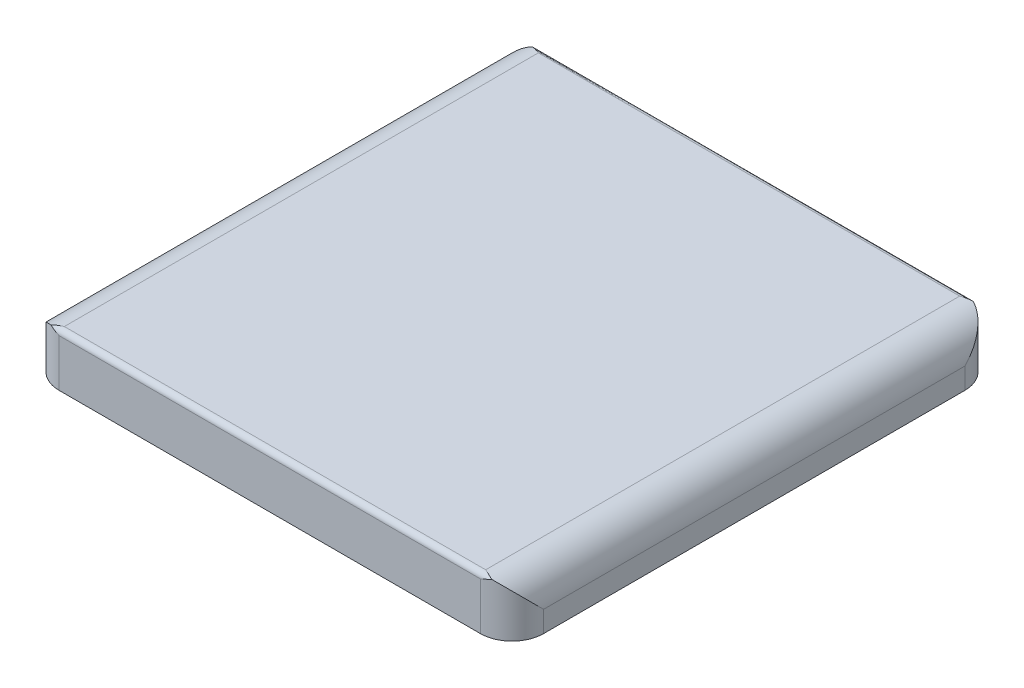
ISO-10303-21;
HEADER;
FILE_DESCRIPTION(('STEP AP214'),'2;1');
FILE_NAME('part.step','',(''),(''),'','','');
FILE_SCHEMA(('AUTOMOTIVE_DESIGN { 1 0 10303 214 1 1 1 1 }'));
ENDSEC;
DATA;
#1=APPLICATION_CONTEXT('core data for automotive mechanical design processes');
#2=APPLICATION_PROTOCOL_DEFINITION('international standard','automotive_design',2000,#1);
#3=PRODUCT_CONTEXT('',#1,'mechanical');
#4=PRODUCT('Part','Part','',(#3));
#5=PRODUCT_RELATED_PRODUCT_CATEGORY('part','',(#4));
#6=PRODUCT_DEFINITION_FORMATION('','',#4);
#7=PRODUCT_DEFINITION_CONTEXT('part definition',#1,'design');
#8=PRODUCT_DEFINITION('design','',#6,#7);
#9=PRODUCT_DEFINITION_SHAPE('','',#8);
#10=(LENGTH_UNIT() NAMED_UNIT(*) SI_UNIT(.MILLI.,.METRE.));
#11=(NAMED_UNIT(*) PLANE_ANGLE_UNIT() SI_UNIT($,.RADIAN.));
#12=(NAMED_UNIT(*) SI_UNIT($,.STERADIAN.) SOLID_ANGLE_UNIT());
#13=UNCERTAINTY_MEASURE_WITH_UNIT(LENGTH_MEASURE(1.E-05),#10,'distance_accuracy_value','');
#14=(GEOMETRIC_REPRESENTATION_CONTEXT(3) GLOBAL_UNCERTAINTY_ASSIGNED_CONTEXT((#13)) GLOBAL_UNIT_ASSIGNED_CONTEXT((#10,
#11,#12)) REPRESENTATION_CONTEXT('',''));
#15=CARTESIAN_POINT('',(0.,0.,0.));
#16=DIRECTION('',(0.,0.,1.));
#17=DIRECTION('',(1.,0.,0.));
#18=AXIS2_PLACEMENT_3D('',#15,#16,#17);
#19=CARTESIAN_POINT('',(50.8,12.7,50.8));
#20=DIRECTION('',(0.,-1.,0.));
#21=DIRECTION('',(0.,0.,-1.));
#22=AXIS2_PLACEMENT_3D('',#19,#20,#21);
#23=CYLINDRICAL_SURFACE('',#22,7.62);
#24=CARTESIAN_POINT('',(50.8,5.08,50.8));
#25=DIRECTION('',(0.,-0.707106781186547,0.707106781186547));
#26=DIRECTION('',(0.,0.707106781186547,0.707106781186547));
#27=AXIS2_PLACEMENT_3D('',#24,#25,#26);
#28=ELLIPSE('',#27,10.776307345283,7.62);
#29=CARTESIAN_POINT('',(58.42,5.08,50.7999999999999));
#30=VERTEX_POINT('',#29);
#31=CARTESIAN_POINT('',(53.1517067687622,12.3280256121069,58.0480256121069));
#32=VERTEX_POINT('',#31);
#33=EDGE_CURVE('E300',#30,#32,#28,.T.);
#34=ORIENTED_EDGE('',*,*,#33,.T.);
#35=CARTESIAN_POINT('',(53.1517067687622,12.3280256121069,58.0480256121069));
#36=CARTESIAN_POINT('',(53.0550511673587,12.2966572162024,58.0793845450704));
#37=CARTESIAN_POINT('',(52.9581477514544,12.264075271135,58.1086911967974));
#38=CARTESIAN_POINT('',(52.7639299968628,12.1968678296105,58.1632573798279));
#39=CARTESIAN_POINT('',(52.6666157346316,12.1622426990522,58.1885176327787));
#40=CARTESIAN_POINT('',(52.3741872794072,12.0558802809113,58.2583173565654));
#41=CARTESIAN_POINT('',(52.1785323287841,11.9816376831499,58.2968935685618));
#42=CARTESIAN_POINT('',(51.7885724327903,11.8298651623855,58.3581527388329));
#43=CARTESIAN_POINT('',(51.5942758205825,11.7523795583816,58.3810033255013));
#44=CARTESIAN_POINT('',(51.2053523408344,11.5954603856371,58.4117084896607));
#45=CARTESIAN_POINT('',(51.0107256756831,11.5160277662501,58.4195702338908));
#46=CARTESIAN_POINT('',(50.8107755866058,11.434399114484,58.4199942835861));
#47=CARTESIAN_POINT('',(50.8053877656628,11.4321995453163,58.4199999976133));
#48=CARTESIAN_POINT('',(50.8,11.43,58.42));
#49=B_SPLINE_CURVE_WITH_KNOTS('',3,(#35,#36,#37,#38,#39,#40,#41,#42,#43,#44,#45,#46,#47,#48),
.UNSPECIFIED.,.F.,.F.,(4,2,2,2,2,2,4),(0.,0.318975929353359,0.637894908053141,1.27555131767104,
1.90630067954775,2.5367483803048,2.55420691108124),.UNSPECIFIED.);
#50=CARTESIAN_POINT('',(50.7999999999999,11.43,58.42));
#51=VERTEX_POINT('',#50);
#52=EDGE_CURVE('E376',#32,#51,#49,.T.);
#53=ORIENTED_EDGE('',*,*,#52,.T.);
#54=DIRECTION('',(0.,-1.,0.));
#55=VECTOR('',#54,1.);
#56=CARTESIAN_POINT('',(50.7999999999999,12.7,58.42));
#57=LINE('',#56,#55);
#58=CARTESIAN_POINT('',(50.7999999999999,0.,58.42));
#59=VERTEX_POINT('',#58);
#60=EDGE_CURVE('E274',#51,#59,#57,.T.);
#61=ORIENTED_EDGE('',*,*,#60,.T.);
#62=CARTESIAN_POINT('',(50.8,0.,50.8));
#63=DIRECTION('',(0.,1.,0.));
#64=DIRECTION('',(0.,0.,1.));
#65=AXIS2_PLACEMENT_3D('',#62,#63,#64);
#66=CIRCLE('',#65,7.62);
#67=CARTESIAN_POINT('',(58.42,0.,50.7999999999999));
#68=VERTEX_POINT('',#67);
#69=EDGE_CURVE('E229',#59,#68,#66,.T.);
#70=ORIENTED_EDGE('',*,*,#69,.T.);
#71=DIRECTION('',(0.,-1.,0.));
#72=VECTOR('',#71,1.);
#73=CARTESIAN_POINT('',(58.42,12.7,50.7999999999999));
#74=LINE('',#73,#72);
#75=EDGE_CURVE('E288',#30,#68,#74,.T.);
#76=ORIENTED_EDGE('',*,*,#75,.F.);
#77=EDGE_LOOP('',(#34,#53,#61,#70,#76));
#78=FACE_BOUND('',#77,.T.);
#79=ADVANCED_FACE('F33',(#78),#23,.T.);
#80=CARTESIAN_POINT('',(58.42,12.7,50.7999999999999));
#81=DIRECTION('',(-1.,0.,0.));
#82=DIRECTION('',(0.,0.,1.));
#83=AXIS2_PLACEMENT_3D('',#80,#81,#82);
#84=PLANE('',#83);
#85=DIRECTION('',(0.,-1.,0.));
#86=VECTOR('',#85,1.);
#87=CARTESIAN_POINT('',(58.42,12.7,-50.7999999999999));
#88=LINE('',#87,#86);
#89=CARTESIAN_POINT('',(58.42,5.08,-50.7999999999999));
#90=VERTEX_POINT('',#89);
#91=CARTESIAN_POINT('',(58.42,0.,-50.7999999999999));
#92=VERTEX_POINT('',#91);
#93=EDGE_CURVE('E286',#90,#92,#88,.T.);
#94=ORIENTED_EDGE('',*,*,#93,.F.);
#95=DIRECTION('',(0.,0.,-1.));
#96=VECTOR('',#95,1.);
#97=CARTESIAN_POINT('',(58.42,5.08,50.7999999999999));
#98=LINE('',#97,#96);
#99=EDGE_CURVE('E298',#90,#30,#98,.F.);
#100=ORIENTED_EDGE('',*,*,#99,.T.);
#101=ORIENTED_EDGE('',*,*,#75,.T.);
#102=DIRECTION('',(0.,0.,-1.));
#103=VECTOR('',#102,1.);
#104=CARTESIAN_POINT('',(58.42,0.,50.7999999999999));
#105=LINE('',#104,#103);
#106=EDGE_CURVE('E253',#68,#92,#105,.T.);
#107=ORIENTED_EDGE('',*,*,#106,.T.);
#108=EDGE_LOOP('',(#94,#100,#101,#107));
#109=FACE_BOUND('',#108,.T.);
#110=ADVANCED_FACE('F368',(#109),#84,.F.);
#111=CARTESIAN_POINT('',(50.8,12.7,-50.8));
#112=DIRECTION('',(0.,-1.,0.));
#113=DIRECTION('',(0.,0.,-1.));
#114=AXIS2_PLACEMENT_3D('',#111,#112,#113);
#115=CYLINDRICAL_SURFACE('',#114,7.62);
#116=DIRECTION('',(0.,-1.,0.));
#117=VECTOR('',#116,1.);
#118=CARTESIAN_POINT('',(50.7999999999999,12.7,-58.42));
#119=LINE('',#118,#117);
#120=CARTESIAN_POINT('',(50.7999999999999,11.43,-58.42));
#121=VERTEX_POINT('',#120);
#122=CARTESIAN_POINT('',(50.7999999999999,0.,-58.42));
#123=VERTEX_POINT('',#122);
#124=EDGE_CURVE('E284',#121,#123,#119,.T.);
#125=ORIENTED_EDGE('',*,*,#124,.F.);
#126=CARTESIAN_POINT('',(53.1517067687622,12.3280256121069,-58.0480256121069));
#127=CARTESIAN_POINT('',(53.0550511673587,12.2966572162024,-58.0793845450704));
#128=CARTESIAN_POINT('',(52.9581477514544,12.264075271135,-58.1086911967974));
#129=CARTESIAN_POINT('',(52.7639299968628,12.1968678296105,-58.1632573798279));
#130=CARTESIAN_POINT('',(52.6666157346316,12.1622426990522,-58.1885176327787));
#131=CARTESIAN_POINT('',(52.3741872794072,12.0558802809113,-58.2583173565654));
#132=CARTESIAN_POINT('',(52.1785323287841,11.9816376831499,-58.2968935685618));
#133=CARTESIAN_POINT('',(51.7885724327903,11.8298651623855,-58.3581527388329));
#134=CARTESIAN_POINT('',(51.5942758205825,11.7523795583816,-58.3810033255013));
#135=CARTESIAN_POINT('',(51.2053523408344,11.5954603856371,-58.4117084896607));
#136=CARTESIAN_POINT('',(51.0107256756831,11.5160277662501,-58.4195702338908));
#137=CARTESIAN_POINT('',(50.8107755866058,11.434399114484,-58.4199942835861));
#138=CARTESIAN_POINT('',(50.8053877656628,11.4321995453163,-58.4199999976133));
#139=CARTESIAN_POINT('',(50.8,11.43,-58.42));
#140=B_SPLINE_CURVE_WITH_KNOTS('',3,(#126,#127,#128,#129,#130,#131,#132,#133,#134,#135,#136,
#137,#138,#139),.UNSPECIFIED.,.F.,.F.,(4,2,2,2,2,2,4),(0.,0.318975929353359,0.637894908053141,
1.27555131767104,1.90630067954775,2.5367483803048,2.55420691108124),.UNSPECIFIED.);
#141=CARTESIAN_POINT('',(53.1517067687622,12.3280256121069,-58.0480256121069));
#142=VERTEX_POINT('',#141);
#143=EDGE_CURVE('E351',#121,#142,#140,.F.);
#144=ORIENTED_EDGE('',*,*,#143,.T.);
#145=CARTESIAN_POINT('',(50.8,5.08,-50.8));
#146=DIRECTION('',(0.,0.707106781186547,0.707106781186547));
#147=DIRECTION('',(0.,-0.707106781186547,0.707106781186547));
#148=AXIS2_PLACEMENT_3D('',#145,#146,#147);
#149=ELLIPSE('',#148,10.776307345283,7.62);
#150=EDGE_CURVE('E296',#142,#90,#149,.F.);
#151=ORIENTED_EDGE('',*,*,#150,.T.);
#152=ORIENTED_EDGE('',*,*,#93,.T.);
#153=CARTESIAN_POINT('',(50.8,0.,-50.8));
#154=DIRECTION('',(0.,1.,0.));
#155=DIRECTION('',(0.,0.,1.));
#156=AXIS2_PLACEMENT_3D('',#153,#154,#155);
#157=CIRCLE('',#156,7.62);
#158=EDGE_CURVE('E256',#92,#123,#157,.T.);
#159=ORIENTED_EDGE('',*,*,#158,.T.);
#160=EDGE_LOOP('',(#125,#144,#151,#152,#159));
#161=FACE_BOUND('',#160,.T.);
#162=ADVANCED_FACE('F362',(#161),#115,.T.);
#163=CARTESIAN_POINT('',(-50.7999999999999,12.7,-58.42));
#164=DIRECTION('',(0.,0.,1.));
#165=DIRECTION('',(1.,0.,0.));
#166=AXIS2_PLACEMENT_3D('',#163,#164,#165);
#167=PLANE('',#166);
#168=DIRECTION('',(0.,-1.,0.));
#169=VECTOR('',#168,1.);
#170=CARTESIAN_POINT('',(-50.7999999999999,12.7,-58.42));
#171=LINE('',#170,#169);
#172=CARTESIAN_POINT('',(-50.7999999999999,11.43,-58.42));
#173=VERTEX_POINT('',#172);
#174=CARTESIAN_POINT('',(-50.7999999999999,0.,-58.42));
#175=VERTEX_POINT('',#174);
#176=EDGE_CURVE('E282',#173,#175,#171,.T.);
#177=ORIENTED_EDGE('',*,*,#176,.F.);
#178=DIRECTION('',(-1.,0.,0.));
#179=VECTOR('',#178,1.);
#180=CARTESIAN_POINT('',(50.7999999999999,11.43,-58.42));
#181=LINE('',#180,#179);
#182=EDGE_CURVE('E358',#173,#121,#181,.F.);
#183=ORIENTED_EDGE('',*,*,#182,.T.);
#184=ORIENTED_EDGE('',*,*,#124,.T.);
#185=DIRECTION('',(-1.,0.,0.));
#186=VECTOR('',#185,1.);
#187=CARTESIAN_POINT('',(-50.7999999999999,0.,-58.42));
#188=LINE('',#187,#186);
#189=EDGE_CURVE('E259',#123,#175,#188,.T.);
#190=ORIENTED_EDGE('',*,*,#189,.T.);
#191=EDGE_LOOP('',(#177,#183,#184,#190));
#192=FACE_BOUND('',#191,.T.);
#193=ADVANCED_FACE('F367',(#192),#167,.F.);
#194=CARTESIAN_POINT('',(-50.8,12.7,-50.8));
#195=DIRECTION('',(0.,-1.,0.));
#196=DIRECTION('',(0.,0.,-1.));
#197=AXIS2_PLACEMENT_3D('',#194,#195,#196);
#198=CYLINDRICAL_SURFACE('',#197,7.62);
#199=CARTESIAN_POINT('',(-50.8,5.08,-50.8));
#200=DIRECTION('',(0.,-0.707106781186547,-0.707106781186547));
#201=DIRECTION('',(0.,0.707106781186547,-0.707106781186547));
#202=AXIS2_PLACEMENT_3D('',#199,#200,#201);
#203=ELLIPSE('',#202,10.776307345283,7.62);
#204=CARTESIAN_POINT('',(-58.42,5.08,-50.7999999999999));
#205=VERTEX_POINT('',#204);
#206=CARTESIAN_POINT('',(-53.1517067687622,12.3280256121069,-58.0480256121069));
#207=VERTEX_POINT('',#206);
#208=EDGE_CURVE('E307',#205,#207,#203,.T.);
#209=ORIENTED_EDGE('',*,*,#208,.T.);
#210=CARTESIAN_POINT('',(-53.1517067687622,12.3280256121069,-58.0480256121069));
#211=CARTESIAN_POINT('',(-53.0550511673587,12.2966572162024,-58.0793845450704));
#212=CARTESIAN_POINT('',(-52.9581477514544,12.264075271135,-58.1086911967974));
#213=CARTESIAN_POINT('',(-52.7639299968628,12.1968678296105,-58.1632573798279));
#214=CARTESIAN_POINT('',(-52.6666157346316,12.1622426990522,-58.1885176327787));
#215=CARTESIAN_POINT('',(-52.3741872794072,12.0558802809114,-58.2583173565654));
#216=CARTESIAN_POINT('',(-52.1785323287841,11.98163768315,-58.2968935685618));
#217=CARTESIAN_POINT('',(-51.7885724327902,11.8298651623854,-58.3581527388329));
#218=CARTESIAN_POINT('',(-51.5942758205825,11.7523795583815,-58.3810033255013));
#219=CARTESIAN_POINT('',(-51.2053523408343,11.5954603856372,-58.4117084896607));
#220=CARTESIAN_POINT('',(-51.010725675683,11.5160277662504,-58.4195702338908));
#221=CARTESIAN_POINT('',(-50.8107755866058,11.434399114484,-58.4199942835861));
#222=CARTESIAN_POINT('',(-50.8053877656628,11.4321995453163,-58.4199999976133));
#223=CARTESIAN_POINT('',(-50.8,11.43,-58.42));
#224=B_SPLINE_CURVE_WITH_KNOTS('',3,(#210,#211,#212,#213,#214,#215,#216,#217,#218,#219,#220,
#221,#222,#223),.UNSPECIFIED.,.F.,.F.,(4,2,2,2,2,2,4),(0.,0.318975929353349,0.637894908053125,
1.27555131767105,1.90630067954778,2.53674838030482,2.55420691108125),.UNSPECIFIED.);
#225=EDGE_CURVE('E344',#207,#173,#224,.T.);
#226=ORIENTED_EDGE('',*,*,#225,.T.);
#227=ORIENTED_EDGE('',*,*,#176,.T.);
#228=CARTESIAN_POINT('',(-50.8,0.,-50.8));
#229=DIRECTION('',(0.,1.,0.));
#230=DIRECTION('',(0.,0.,1.));
#231=AXIS2_PLACEMENT_3D('',#228,#229,#230);
#232=CIRCLE('',#231,7.62);
#233=CARTESIAN_POINT('',(-58.42,0.,-50.7999999999999));
#234=VERTEX_POINT('',#233);
#235=EDGE_CURVE('E262',#175,#234,#232,.T.);
#236=ORIENTED_EDGE('',*,*,#235,.T.);
#237=DIRECTION('',(0.,-1.,0.));
#238=VECTOR('',#237,1.);
#239=CARTESIAN_POINT('',(-58.42,12.7,-50.7999999999999));
#240=LINE('',#239,#238);
#241=EDGE_CURVE('E280',#205,#234,#240,.T.);
#242=ORIENTED_EDGE('',*,*,#241,.F.);
#243=EDGE_LOOP('',(#209,#226,#227,#236,#242));
#244=FACE_BOUND('',#243,.T.);
#245=ADVANCED_FACE('F407',(#244),#198,.T.);
#246=CARTESIAN_POINT('',(-58.42,12.7,50.7999999999999));
#247=DIRECTION('',(1.,0.,0.));
#248=DIRECTION('',(0.,0.,-1.));
#249=AXIS2_PLACEMENT_3D('',#246,#247,#248);
#250=PLANE('',#249);
#251=DIRECTION('',(0.,-1.,0.));
#252=VECTOR('',#251,1.);
#253=CARTESIAN_POINT('',(-58.42,12.7,50.7999999999999));
#254=LINE('',#253,#252);
#255=CARTESIAN_POINT('',(-58.42,5.08,50.7999999999999));
#256=VERTEX_POINT('',#255);
#257=CARTESIAN_POINT('',(-58.42,0.,50.7999999999999));
#258=VERTEX_POINT('',#257);
#259=EDGE_CURVE('E278',#256,#258,#254,.T.);
#260=ORIENTED_EDGE('',*,*,#259,.F.);
#261=DIRECTION('',(0.,0.,1.));
#262=VECTOR('',#261,1.);
#263=CARTESIAN_POINT('',(-58.42,5.08,-50.7999999999999));
#264=LINE('',#263,#262);
#265=EDGE_CURVE('E305',#256,#205,#264,.F.);
#266=ORIENTED_EDGE('',*,*,#265,.T.);
#267=ORIENTED_EDGE('',*,*,#241,.T.);
#268=DIRECTION('',(0.,0.,1.));
#269=VECTOR('',#268,1.);
#270=CARTESIAN_POINT('',(-58.42,0.,50.7999999999999));
#271=LINE('',#270,#269);
#272=EDGE_CURVE('E265',#234,#258,#271,.T.);
#273=ORIENTED_EDGE('',*,*,#272,.T.);
#274=EDGE_LOOP('',(#260,#266,#267,#273));
#275=FACE_BOUND('',#274,.T.);
#276=ADVANCED_FACE('F405',(#275),#250,.F.);
#277=CARTESIAN_POINT('',(-50.8,12.7,50.8));
#278=DIRECTION('',(0.,-1.,0.));
#279=DIRECTION('',(0.,0.,-1.));
#280=AXIS2_PLACEMENT_3D('',#277,#278,#279);
#281=CYLINDRICAL_SURFACE('',#280,7.62);
#282=DIRECTION('',(0.,-1.,0.));
#283=VECTOR('',#282,1.);
#284=CARTESIAN_POINT('',(-50.7999999999999,12.7,58.42));
#285=LINE('',#284,#283);
#286=CARTESIAN_POINT('',(-50.7999999999999,11.43,58.42));
#287=VERTEX_POINT('',#286);
#288=CARTESIAN_POINT('',(-50.7999999999999,0.,58.42));
#289=VERTEX_POINT('',#288);
#290=EDGE_CURVE('E276',#287,#289,#285,.T.);
#291=ORIENTED_EDGE('',*,*,#290,.F.);
#292=CARTESIAN_POINT('',(-53.1517067687622,12.3280256121069,58.0480256121069));
#293=CARTESIAN_POINT('',(-53.0550511673587,12.2966572162024,58.0793845450704));
#294=CARTESIAN_POINT('',(-52.9581477514544,12.264075271135,58.1086911967974));
#295=CARTESIAN_POINT('',(-52.7639299968628,12.1968678296105,58.1632573798279));
#296=CARTESIAN_POINT('',(-52.6666157346316,12.1622426990522,58.1885176327787));
#297=CARTESIAN_POINT('',(-52.3741872794072,12.0558802809114,58.2583173565654));
#298=CARTESIAN_POINT('',(-52.1785323287841,11.98163768315,58.2968935685618));
#299=CARTESIAN_POINT('',(-51.7885724327902,11.8298651623854,58.3581527388329));
#300=CARTESIAN_POINT('',(-51.5942758205825,11.7523795583815,58.3810033255013));
#301=CARTESIAN_POINT('',(-51.2053523408343,11.5954603856372,58.4117084896607));
#302=CARTESIAN_POINT('',(-51.010725675683,11.5160277662504,58.4195702338908));
#303=CARTESIAN_POINT('',(-50.8107755866058,11.434399114484,58.4199942835861));
#304=CARTESIAN_POINT('',(-50.8053877656628,11.4321995453163,58.4199999976133));
#305=CARTESIAN_POINT('',(-50.8,11.43,58.42));
#306=B_SPLINE_CURVE_WITH_KNOTS('',3,(#292,#293,#294,#295,#296,#297,#298,#299,#300,#301,#302,
#303,#304,#305),.UNSPECIFIED.,.F.,.F.,(4,2,2,2,2,2,4),(0.,0.318975929353349,0.637894908053125,
1.27555131767105,1.90630067954778,2.53674838030482,2.55420691108125),.UNSPECIFIED.);
#307=CARTESIAN_POINT('',(-53.1517067687622,12.3280256121069,58.0480256121069));
#308=VERTEX_POINT('',#307);
#309=EDGE_CURVE('E11',#287,#308,#306,.F.);
#310=ORIENTED_EDGE('',*,*,#309,.T.);
#311=CARTESIAN_POINT('',(-50.8,5.08,50.8));
#312=DIRECTION('',(0.,0.707106781186547,-0.707106781186547));
#313=DIRECTION('',(0.,-0.707106781186547,-0.707106781186547));
#314=AXIS2_PLACEMENT_3D('',#311,#312,#313);
#315=ELLIPSE('',#314,10.776307345283,7.62);
#316=EDGE_CURVE('E303',#308,#256,#315,.F.);
#317=ORIENTED_EDGE('',*,*,#316,.T.);
#318=ORIENTED_EDGE('',*,*,#259,.T.);
#319=CARTESIAN_POINT('',(-50.8,0.,50.8));
#320=DIRECTION('',(0.,1.,0.));
#321=DIRECTION('',(0.,0.,1.));
#322=AXIS2_PLACEMENT_3D('',#319,#320,#321);
#323=CIRCLE('',#322,7.62);
#324=EDGE_CURVE('E268',#258,#289,#323,.T.);
#325=ORIENTED_EDGE('',*,*,#324,.T.);
#326=EDGE_LOOP('',(#291,#310,#317,#318,#325));
#327=FACE_BOUND('',#326,.T.);
#328=ADVANCED_FACE('F398',(#327),#281,.T.);
#329=CARTESIAN_POINT('',(-50.7999999999999,12.7,58.42));
#330=DIRECTION('',(0.,0.,-1.));
#331=DIRECTION('',(-1.,0.,0.));
#332=AXIS2_PLACEMENT_3D('',#329,#330,#331);
#333=PLANE('',#332);
#334=ORIENTED_EDGE('',*,*,#60,.F.);
#335=DIRECTION('',(1.,0.,0.));
#336=VECTOR('',#335,1.);
#337=CARTESIAN_POINT('',(-50.7999999999999,11.43,58.42));
#338=LINE('',#337,#336);
#339=EDGE_CURVE('E46',#51,#287,#338,.F.);
#340=ORIENTED_EDGE('',*,*,#339,.T.);
#341=ORIENTED_EDGE('',*,*,#290,.T.);
#342=DIRECTION('',(1.,0.,0.));
#343=VECTOR('',#342,1.);
#344=CARTESIAN_POINT('',(-50.7999999999999,0.,58.42));
#345=LINE('',#344,#343);
#346=EDGE_CURVE('E271',#289,#59,#345,.T.);
#347=ORIENTED_EDGE('',*,*,#346,.T.);
#348=EDGE_LOOP('',(#334,#340,#341,#347));
#349=FACE_BOUND('',#348,.T.);
#350=ADVANCED_FACE('F419',(#349),#333,.F.);
#351=CARTESIAN_POINT('',(50.8,12.7,50.8));
#352=DIRECTION('',(0.,1.,0.));
#353=DIRECTION('',(0.,0.,1.));
#354=AXIS2_PLACEMENT_3D('',#351,#352,#353);
#355=PLANE('',#354);
#356=DIRECTION('',(0.,0.,-1.));
#357=VECTOR('',#356,1.);
#358=CARTESIAN_POINT('',(50.8,12.7,-50.7999999999999));
#359=LINE('',#358,#357);
#360=CARTESIAN_POINT('',(50.8,12.7,57.15));
#361=VERTEX_POINT('',#360);
#362=CARTESIAN_POINT('',(50.8,12.7,-57.15));
#363=VERTEX_POINT('',#362);
#364=EDGE_CURVE('E293',#361,#363,#359,.T.);
#365=ORIENTED_EDGE('',*,*,#364,.T.);
#366=DIRECTION('',(-1.,0.,0.));
#367=VECTOR('',#366,1.);
#368=CARTESIAN_POINT('',(-50.7999999999999,12.7,-57.15));
#369=LINE('',#368,#367);
#370=CARTESIAN_POINT('',(-50.8,12.7,-57.15));
#371=VERTEX_POINT('',#370);
#372=EDGE_CURVE('E313',#363,#371,#369,.T.);
#373=ORIENTED_EDGE('',*,*,#372,.T.);
#374=DIRECTION('',(0.,0.,1.));
#375=VECTOR('',#374,1.);
#376=CARTESIAN_POINT('',(-50.8,12.7,50.7999999999999));
#377=LINE('',#376,#375);
#378=CARTESIAN_POINT('',(-50.8,12.7,57.15));
#379=VERTEX_POINT('',#378);
#380=EDGE_CURVE('E290',#371,#379,#377,.T.);
#381=ORIENTED_EDGE('',*,*,#380,.T.);
#382=DIRECTION('',(1.,0.,0.));
#383=VECTOR('',#382,1.);
#384=CARTESIAN_POINT('',(50.7999999999999,12.7,57.15));
#385=LINE('',#384,#383);
#386=EDGE_CURVE('E310',#379,#361,#385,.T.);
#387=ORIENTED_EDGE('',*,*,#386,.T.);
#388=EDGE_LOOP('',(#365,#373,#381,#387));
#389=FACE_BOUND('',#388,.T.);
#390=ADVANCED_FACE('F421',(#389),#355,.T.);
#391=CARTESIAN_POINT('',(50.8,0.,50.8));
#392=DIRECTION('',(0.,1.,0.));
#393=DIRECTION('',(0.,0.,1.));
#394=AXIS2_PLACEMENT_3D('',#391,#392,#393);
#395=PLANE('',#394);
#396=DIRECTION('',(1.,0.,0.));
#397=VECTOR('',#396,1.);
#398=CARTESIAN_POINT('',(-50.7999999999999,0.,56.642));
#399=LINE('',#398,#397);
#400=CARTESIAN_POINT('',(-50.7999999999999,0.,56.642));
#401=VERTEX_POINT('',#400);
#402=CARTESIAN_POINT('',(50.8,0.,56.642));
#403=VERTEX_POINT('',#402);
#404=EDGE_CURVE('E205',#401,#403,#399,.T.);
#405=ORIENTED_EDGE('',*,*,#404,.T.);
#406=CARTESIAN_POINT('',(50.8,0.,50.8));
#407=DIRECTION('',(0.,1.,0.));
#408=DIRECTION('',(0.,0.,1.));
#409=AXIS2_PLACEMENT_3D('',#406,#407,#408);
#410=CIRCLE('',#409,5.842);
#411=CARTESIAN_POINT('',(56.642,0.,50.7999999999999));
#412=VERTEX_POINT('',#411);
#413=EDGE_CURVE('E233',#403,#412,#410,.T.);
#414=ORIENTED_EDGE('',*,*,#413,.T.);
#415=DIRECTION('',(0.,0.,-1.));
#416=VECTOR('',#415,1.);
#417=CARTESIAN_POINT('',(56.642,0.,50.7999999999999));
#418=LINE('',#417,#416);
#419=CARTESIAN_POINT('',(56.642,0.,-50.8));
#420=VERTEX_POINT('',#419);
#421=EDGE_CURVE('E189',#412,#420,#418,.T.);
#422=ORIENTED_EDGE('',*,*,#421,.T.);
#423=CARTESIAN_POINT('',(50.8,0.,-50.8));
#424=DIRECTION('',(0.,1.,0.));
#425=DIRECTION('',(0.,0.,1.));
#426=AXIS2_PLACEMENT_3D('',#423,#424,#425);
#427=CIRCLE('',#426,5.842);
#428=CARTESIAN_POINT('',(50.7999999999999,0.,-56.642));
#429=VERTEX_POINT('',#428);
#430=EDGE_CURVE('E53',#420,#429,#427,.T.);
#431=ORIENTED_EDGE('',*,*,#430,.T.);
#432=DIRECTION('',(-1.,0.,0.));
#433=VECTOR('',#432,1.);
#434=CARTESIAN_POINT('',(-50.7999999999999,0.,-56.642));
#435=LINE('',#434,#433);
#436=CARTESIAN_POINT('',(-50.8,0.,-56.642));
#437=VERTEX_POINT('',#436);
#438=EDGE_CURVE('E246',#429,#437,#435,.T.);
#439=ORIENTED_EDGE('',*,*,#438,.T.);
#440=CARTESIAN_POINT('',(-50.8,0.,-50.8));
#441=DIRECTION('',(0.,1.,0.));
#442=DIRECTION('',(0.,0.,1.));
#443=AXIS2_PLACEMENT_3D('',#440,#441,#442);
#444=CIRCLE('',#443,5.842);
#445=CARTESIAN_POINT('',(-56.642,0.,-50.7999999999999));
#446=VERTEX_POINT('',#445);
#447=EDGE_CURVE('E243',#437,#446,#444,.T.);
#448=ORIENTED_EDGE('',*,*,#447,.T.);
#449=DIRECTION('',(0.,0.,1.));
#450=VECTOR('',#449,1.);
#451=CARTESIAN_POINT('',(-56.642,0.,50.7999999999999));
#452=LINE('',#451,#450);
#453=CARTESIAN_POINT('',(-56.642,0.,50.8));
#454=VERTEX_POINT('',#453);
#455=EDGE_CURVE('E240',#446,#454,#452,.T.);
#456=ORIENTED_EDGE('',*,*,#455,.T.);
#457=CARTESIAN_POINT('',(-50.8,0.,50.8));
#458=DIRECTION('',(0.,1.,0.));
#459=DIRECTION('',(0.,0.,1.));
#460=AXIS2_PLACEMENT_3D('',#457,#458,#459);
#461=CIRCLE('',#460,5.842);
#462=EDGE_CURVE('E237',#454,#401,#461,.T.);
#463=ORIENTED_EDGE('',*,*,#462,.T.);
#464=EDGE_LOOP('',(#405,#414,#422,#431,#439,#448,#456,#463));
#465=FACE_BOUND('',#464,.T.);
#466=ORIENTED_EDGE('',*,*,#69,.F.);
#467=ORIENTED_EDGE('',*,*,#346,.F.);
#468=ORIENTED_EDGE('',*,*,#324,.F.);
#469=ORIENTED_EDGE('',*,*,#272,.F.);
#470=ORIENTED_EDGE('',*,*,#235,.F.);
#471=ORIENTED_EDGE('',*,*,#189,.F.);
#472=ORIENTED_EDGE('',*,*,#158,.F.);
#473=ORIENTED_EDGE('',*,*,#106,.F.);
#474=EDGE_LOOP('',(#466,#467,#468,#469,#470,#471,#472,#473));
#475=FACE_BOUND('',#474,.T.);
#476=ADVANCED_FACE('F416',(#465,#475),#395,.F.);
#477=CARTESIAN_POINT('',(50.8,5.08,50.8));
#478=DIRECTION('',(0.,0.,1.));
#479=DIRECTION('',(1.,0.,0.));
#480=AXIS2_PLACEMENT_3D('',#477,#478,#479);
#481=CYLINDRICAL_SURFACE('',#480,7.62);
#482=ORIENTED_EDGE('',*,*,#150,.F.);
#483=CARTESIAN_POINT('',(53.1517067687622,12.3280256121069,-58.0480256121069));
#484=CARTESIAN_POINT('',(53.0550511673587,12.3593845450704,-58.0166572162025));
#485=CARTESIAN_POINT('',(52.9581477514544,12.3886911967974,-57.984075271135));
#486=CARTESIAN_POINT('',(52.7639299968629,12.4432573798278,-57.9168678296105));
#487=CARTESIAN_POINT('',(52.6666157346318,12.4685176327786,-57.8822426990522));
#488=CARTESIAN_POINT('',(52.3741872794072,12.5383173565654,-57.7758802809115));
#489=CARTESIAN_POINT('',(52.1785323287839,12.5768935685618,-57.7016376831504));
#490=CARTESIAN_POINT('',(51.7885724327904,12.6381527388329,-57.549865162385));
#491=CARTESIAN_POINT('',(51.5942758205831,12.6610033255014,-57.4723795583798));
#492=CARTESIAN_POINT('',(51.2053523408336,12.6917084896607,-57.3154603856388));
#493=CARTESIAN_POINT('',(51.0107256756804,12.6995702338908,-57.2360277662566));
#494=CARTESIAN_POINT('',(50.8107755866057,12.6999942835861,-57.1543991144844));
#495=CARTESIAN_POINT('',(50.8053877656627,12.6999999976133,-57.1521995453164));
#496=CARTESIAN_POINT('',(50.8,12.7,-57.15));
#497=B_SPLINE_CURVE_WITH_KNOTS('',3,(#483,#484,#485,#486,#487,#488,#489,#490,#491,#492,#493,
#494,#495,#496),.UNSPECIFIED.,.F.,.F.,(4,2,2,2,2,2,4),(0.,0.318975929353228,0.637894908052898,
1.27555131767113,1.90630067954784,2.53674838030481,2.55420691108124),.UNSPECIFIED.);
#498=EDGE_CURVE('E380',#142,#363,#497,.T.);
#499=ORIENTED_EDGE('',*,*,#498,.T.);
#500=ORIENTED_EDGE('',*,*,#364,.F.);
#501=CARTESIAN_POINT('',(53.1517067687622,12.3280256121069,58.0480256121069));
#502=CARTESIAN_POINT('',(53.0550511673587,12.3593845450704,58.0166572162025));
#503=CARTESIAN_POINT('',(52.9581477514544,12.3886911967974,57.984075271135));
#504=CARTESIAN_POINT('',(52.7639299968629,12.4432573798278,57.9168678296105));
#505=CARTESIAN_POINT('',(52.6666157346318,12.4685176327786,57.8822426990522));
#506=CARTESIAN_POINT('',(52.3741872794072,12.5383173565654,57.7758802809115));
#507=CARTESIAN_POINT('',(52.1785323287839,12.5768935685618,57.7016376831504));
#508=CARTESIAN_POINT('',(51.7885724327904,12.6381527388329,57.549865162385));
#509=CARTESIAN_POINT('',(51.5942758205831,12.6610033255014,57.4723795583798));
#510=CARTESIAN_POINT('',(51.2053523408336,12.6917084896607,57.3154603856388));
#511=CARTESIAN_POINT('',(51.0107256756804,12.6995702338908,57.2360277662566));
#512=CARTESIAN_POINT('',(50.8107755866057,12.6999942835861,57.1543991144844));
#513=CARTESIAN_POINT('',(50.8053877656627,12.6999999976133,57.1521995453164));
#514=CARTESIAN_POINT('',(50.8,12.7,57.15));
#515=B_SPLINE_CURVE_WITH_KNOTS('',3,(#501,#502,#503,#504,#505,#506,#507,#508,#509,#510,#511,
#512,#513,#514),.UNSPECIFIED.,.F.,.F.,(4,2,2,2,2,2,4),(0.,0.318975929353228,0.637894908052898,
1.27555131767113,1.90630067954784,2.53674838030481,2.55420691108124),.UNSPECIFIED.);
#516=EDGE_CURVE('E357',#361,#32,#515,.F.);
#517=ORIENTED_EDGE('',*,*,#516,.T.);
#518=ORIENTED_EDGE('',*,*,#33,.F.);
#519=ORIENTED_EDGE('',*,*,#99,.F.);
#520=EDGE_LOOP('',(#482,#499,#500,#517,#518,#519));
#521=FACE_BOUND('',#520,.T.);
#522=ADVANCED_FACE('F332',(#521),#481,.T.);
#523=CARTESIAN_POINT('',(-50.8,5.08,50.8));
#524=DIRECTION('',(0.,0.,-1.));
#525=DIRECTION('',(-1.,0.,0.));
#526=AXIS2_PLACEMENT_3D('',#523,#524,#525);
#527=CYLINDRICAL_SURFACE('',#526,7.62);
#528=ORIENTED_EDGE('',*,*,#380,.F.);
#529=CARTESIAN_POINT('',(-53.1517067687622,12.3280256121069,-58.0480256121069));
#530=CARTESIAN_POINT('',(-53.0550511673587,12.3593845450704,-58.0166572162025));
#531=CARTESIAN_POINT('',(-52.9581477514544,12.3886911967974,-57.984075271135));
#532=CARTESIAN_POINT('',(-52.7639299968629,12.4432573798278,-57.9168678296105));
#533=CARTESIAN_POINT('',(-52.6666157346318,12.4685176327786,-57.8822426990522));
#534=CARTESIAN_POINT('',(-52.3741872794072,12.5383173565654,-57.7758802809115));
#535=CARTESIAN_POINT('',(-52.1785323287839,12.5768935685618,-57.7016376831504));
#536=CARTESIAN_POINT('',(-51.7885724327904,12.6381527388329,-57.549865162385));
#537=CARTESIAN_POINT('',(-51.5942758205831,12.6610033255014,-57.4723795583798));
#538=CARTESIAN_POINT('',(-51.2053523408336,12.6917084896607,-57.3154603856388));
#539=CARTESIAN_POINT('',(-51.0107256756804,12.6995702338908,-57.2360277662566));
#540=CARTESIAN_POINT('',(-50.8107755866057,12.6999942835861,-57.1543991144844));
#541=CARTESIAN_POINT('',(-50.8053877656627,12.6999999976133,-57.1521995453164));
#542=CARTESIAN_POINT('',(-50.8,12.7,-57.15));
#543=B_SPLINE_CURVE_WITH_KNOTS('',3,(#529,#530,#531,#532,#533,#534,#535,#536,#537,#538,#539,
#540,#541,#542),.UNSPECIFIED.,.F.,.F.,(4,2,2,2,2,2,4),(0.,0.318975929353228,0.637894908052898,
1.27555131767113,1.90630067954784,2.53674838030481,2.55420691108124),.UNSPECIFIED.);
#544=EDGE_CURVE('E322',#371,#207,#543,.F.);
#545=ORIENTED_EDGE('',*,*,#544,.T.);
#546=ORIENTED_EDGE('',*,*,#208,.F.);
#547=ORIENTED_EDGE('',*,*,#265,.F.);
#548=ORIENTED_EDGE('',*,*,#316,.F.);
#549=CARTESIAN_POINT('',(-53.1517067687622,12.3280256121069,58.0480256121069));
#550=CARTESIAN_POINT('',(-53.0550511673587,12.3593845450704,58.0166572162025));
#551=CARTESIAN_POINT('',(-52.9581477514544,12.3886911967974,57.984075271135));
#552=CARTESIAN_POINT('',(-52.7639299968629,12.4432573798278,57.9168678296105));
#553=CARTESIAN_POINT('',(-52.6666157346318,12.4685176327786,57.8822426990522));
#554=CARTESIAN_POINT('',(-52.3741872794072,12.5383173565654,57.7758802809115));
#555=CARTESIAN_POINT('',(-52.1785323287839,12.5768935685618,57.7016376831504));
#556=CARTESIAN_POINT('',(-51.7885724327904,12.6381527388329,57.549865162385));
#557=CARTESIAN_POINT('',(-51.5942758205831,12.6610033255014,57.4723795583798));
#558=CARTESIAN_POINT('',(-51.2053523408336,12.6917084896607,57.3154603856388));
#559=CARTESIAN_POINT('',(-51.0107256756804,12.6995702338908,57.2360277662566));
#560=CARTESIAN_POINT('',(-50.8107755866057,12.6999942835861,57.1543991144844));
#561=CARTESIAN_POINT('',(-50.8053877656627,12.6999999976133,57.1521995453164));
#562=CARTESIAN_POINT('',(-50.8,12.7,57.15));
#563=B_SPLINE_CURVE_WITH_KNOTS('',3,(#549,#550,#551,#552,#553,#554,#555,#556,#557,#558,#559,
#560,#561,#562),.UNSPECIFIED.,.F.,.F.,(4,2,2,2,2,2,4),(0.,0.318975929353228,0.637894908052898,
1.27555131767113,1.90630067954784,2.53674838030481,2.55420691108124),.UNSPECIFIED.);
#564=EDGE_CURVE('E316',#308,#379,#563,.T.);
#565=ORIENTED_EDGE('',*,*,#564,.T.);
#566=EDGE_LOOP('',(#528,#545,#546,#547,#548,#565));
#567=FACE_BOUND('',#566,.T.);
#568=ADVANCED_FACE('F327',(#567),#527,.T.);
#569=CARTESIAN_POINT('',(50.8,11.43,-57.15));
#570=DIRECTION('',(1.,0.,0.));
#571=DIRECTION('',(0.,0.,-1.));
#572=AXIS2_PLACEMENT_3D('',#569,#570,#571);
#573=CYLINDRICAL_SURFACE('',#572,1.27);
#574=ORIENTED_EDGE('',*,*,#143,.F.);
#575=ORIENTED_EDGE('',*,*,#182,.F.);
#576=ORIENTED_EDGE('',*,*,#225,.F.);
#577=ORIENTED_EDGE('',*,*,#544,.F.);
#578=ORIENTED_EDGE('',*,*,#372,.F.);
#579=ORIENTED_EDGE('',*,*,#498,.F.);
#580=EDGE_LOOP('',(#574,#575,#576,#577,#578,#579));
#581=FACE_BOUND('',#580,.T.);
#582=ADVANCED_FACE('F331',(#581),#573,.T.);
#583=CARTESIAN_POINT('',(50.8,11.43,57.15));
#584=DIRECTION('',(-1.,0.,0.));
#585=DIRECTION('',(0.,0.,1.));
#586=AXIS2_PLACEMENT_3D('',#583,#584,#585);
#587=CYLINDRICAL_SURFACE('',#586,1.27);
#588=ORIENTED_EDGE('',*,*,#309,.F.);
#589=ORIENTED_EDGE('',*,*,#339,.F.);
#590=ORIENTED_EDGE('',*,*,#52,.F.);
#591=ORIENTED_EDGE('',*,*,#516,.F.);
#592=ORIENTED_EDGE('',*,*,#386,.F.);
#593=ORIENTED_EDGE('',*,*,#564,.F.);
#594=EDGE_LOOP('',(#588,#589,#590,#591,#592,#593));
#595=FACE_BOUND('',#594,.T.);
#596=ADVANCED_FACE('F35',(#595),#587,.T.);
#597=CARTESIAN_POINT('',(50.8,12.7,50.8));
#598=DIRECTION('',(0.,-1.,0.));
#599=DIRECTION('',(0.,0.,-1.));
#600=AXIS2_PLACEMENT_3D('',#597,#598,#599);
#601=CYLINDRICAL_SURFACE('',#600,5.842);
#602=CARTESIAN_POINT('',(50.8,5.08,50.8));
#603=DIRECTION('',(0.,-0.707106781186547,0.707106781186547));
#604=DIRECTION('',(0.,0.707106781186547,0.707106781186547));
#605=AXIS2_PLACEMENT_3D('',#602,#603,#604);
#606=ELLIPSE('',#605,8.26183563138362,5.842);
#607=CARTESIAN_POINT('',(56.642,5.08,50.7999999999999));
#608=VERTEX_POINT('',#607);
#609=CARTESIAN_POINT('',(50.8,10.922,56.642));
#610=VERTEX_POINT('',#609);
#611=EDGE_CURVE('E180',#608,#610,#606,.T.);
#612=ORIENTED_EDGE('',*,*,#611,.F.);
#613=DIRECTION('',(0.,1.,0.));
#614=VECTOR('',#613,1.);
#615=CARTESIAN_POINT('',(56.642,12.7,50.7999999999999));
#616=LINE('',#615,#614);
#617=EDGE_CURVE('E186',#608,#412,#616,.F.);
#618=ORIENTED_EDGE('',*,*,#617,.T.);
#619=ORIENTED_EDGE('',*,*,#413,.F.);
#620=DIRECTION('',(0.,-1.,0.));
#621=VECTOR('',#620,1.);
#622=CARTESIAN_POINT('',(50.8,12.7,56.642));
#623=LINE('',#622,#621);
#624=EDGE_CURVE('E198',#610,#403,#623,.T.);
#625=ORIENTED_EDGE('',*,*,#624,.F.);
#626=EDGE_LOOP('',(#612,#618,#619,#625));
#627=FACE_BOUND('',#626,.T.);
#628=ADVANCED_FACE('F197',(#627),#601,.F.);
#629=CARTESIAN_POINT('',(56.642,12.7,50.7999999999999));
#630=DIRECTION('',(-1.,0.,0.));
#631=DIRECTION('',(0.,0.,1.));
#632=AXIS2_PLACEMENT_3D('',#629,#630,#631);
#633=PLANE('',#632);
#634=DIRECTION('',(0.,-1.,0.));
#635=VECTOR('',#634,1.);
#636=CARTESIAN_POINT('',(56.642,12.7,-50.8));
#637=LINE('',#636,#635);
#638=CARTESIAN_POINT('',(56.642,5.08,-50.8));
#639=VERTEX_POINT('',#638);
#640=EDGE_CURVE('E194',#639,#420,#637,.T.);
#641=ORIENTED_EDGE('',*,*,#640,.T.);
#642=ORIENTED_EDGE('',*,*,#421,.F.);
#643=ORIENTED_EDGE('',*,*,#617,.F.);
#644=DIRECTION('',(0.,0.,1.));
#645=VECTOR('',#644,1.);
#646=CARTESIAN_POINT('',(56.642,5.08,50.7999999999999));
#647=LINE('',#646,#645);
#648=EDGE_CURVE('E175',#639,#608,#647,.T.);
#649=ORIENTED_EDGE('',*,*,#648,.F.);
#650=EDGE_LOOP('',(#641,#642,#643,#649));
#651=FACE_BOUND('',#650,.T.);
#652=ADVANCED_FACE('F187',(#651),#633,.T.);
#653=CARTESIAN_POINT('',(50.8,12.7,-50.8));
#654=DIRECTION('',(0.,-1.,0.));
#655=DIRECTION('',(0.,0.,-1.));
#656=AXIS2_PLACEMENT_3D('',#653,#654,#655);
#657=CYLINDRICAL_SURFACE('',#656,5.842);
#658=DIRECTION('',(0.,1.,0.));
#659=VECTOR('',#658,1.);
#660=CARTESIAN_POINT('',(50.7999999999999,12.7,-56.642));
#661=LINE('',#660,#659);
#662=CARTESIAN_POINT('',(50.8,10.922,-56.642));
#663=VERTEX_POINT('',#662);
#664=EDGE_CURVE('E207',#663,#429,#661,.F.);
#665=ORIENTED_EDGE('',*,*,#664,.T.);
#666=ORIENTED_EDGE('',*,*,#430,.F.);
#667=ORIENTED_EDGE('',*,*,#640,.F.);
#668=CARTESIAN_POINT('',(50.8,5.08,-50.8));
#669=DIRECTION('',(0.,0.707106781186547,0.707106781186547));
#670=DIRECTION('',(0.,-0.707106781186547,0.707106781186547));
#671=AXIS2_PLACEMENT_3D('',#668,#669,#670);
#672=ELLIPSE('',#671,8.26183563138362,5.842);
#673=EDGE_CURVE('E182',#663,#639,#672,.F.);
#674=ORIENTED_EDGE('',*,*,#673,.F.);
#675=EDGE_LOOP('',(#665,#666,#667,#674));
#676=FACE_BOUND('',#675,.T.);
#677=ADVANCED_FACE('F534',(#676),#657,.F.);
#678=CARTESIAN_POINT('',(-50.7999999999999,12.7,-56.642));
#679=DIRECTION('',(0.,0.,1.));
#680=DIRECTION('',(1.,0.,0.));
#681=AXIS2_PLACEMENT_3D('',#678,#679,#680);
#682=PLANE('',#681);
#683=DIRECTION('',(0.,-1.,0.));
#684=VECTOR('',#683,1.);
#685=CARTESIAN_POINT('',(-50.8,12.7,-56.642));
#686=LINE('',#685,#684);
#687=CARTESIAN_POINT('',(-50.8,10.922,-56.642));
#688=VERTEX_POINT('',#687);
#689=EDGE_CURVE('E210',#688,#437,#686,.T.);
#690=ORIENTED_EDGE('',*,*,#689,.T.);
#691=ORIENTED_EDGE('',*,*,#438,.F.);
#692=ORIENTED_EDGE('',*,*,#664,.F.);
#693=DIRECTION('',(1.,0.,0.));
#694=VECTOR('',#693,1.);
#695=CARTESIAN_POINT('',(50.8,10.922,-56.642));
#696=LINE('',#695,#694);
#697=EDGE_CURVE('E215',#688,#663,#696,.T.);
#698=ORIENTED_EDGE('',*,*,#697,.F.);
#699=EDGE_LOOP('',(#690,#691,#692,#698));
#700=FACE_BOUND('',#699,.T.);
#701=ADVANCED_FACE('F543',(#700),#682,.T.);
#702=CARTESIAN_POINT('',(-50.8,12.7,-50.8));
#703=DIRECTION('',(0.,-1.,0.));
#704=DIRECTION('',(0.,0.,-1.));
#705=AXIS2_PLACEMENT_3D('',#702,#703,#704);
#706=CYLINDRICAL_SURFACE('',#705,5.842);
#707=CARTESIAN_POINT('',(-50.8,5.08,-50.8));
#708=DIRECTION('',(0.,-0.707106781186547,-0.707106781186547));
#709=DIRECTION('',(0.,0.707106781186547,-0.707106781186547));
#710=AXIS2_PLACEMENT_3D('',#707,#708,#709);
#711=ELLIPSE('',#710,8.26183563138362,5.842);
#712=CARTESIAN_POINT('',(-56.642,5.08,-50.7999999999999));
#713=VERTEX_POINT('',#712);
#714=EDGE_CURVE('E219',#713,#688,#711,.T.);
#715=ORIENTED_EDGE('',*,*,#714,.F.);
#716=DIRECTION('',(0.,1.,0.));
#717=VECTOR('',#716,1.);
#718=CARTESIAN_POINT('',(-56.642,12.7,-50.7999999999999));
#719=LINE('',#718,#717);
#720=EDGE_CURVE('E214',#713,#446,#719,.F.);
#721=ORIENTED_EDGE('',*,*,#720,.T.);
#722=ORIENTED_EDGE('',*,*,#447,.F.);
#723=ORIENTED_EDGE('',*,*,#689,.F.);
#724=EDGE_LOOP('',(#715,#721,#722,#723));
#725=FACE_BOUND('',#724,.T.);
#726=ADVANCED_FACE('F552',(#725),#706,.F.);
#727=CARTESIAN_POINT('',(-56.642,12.7,50.7999999999999));
#728=DIRECTION('',(1.,0.,0.));
#729=DIRECTION('',(0.,0.,-1.));
#730=AXIS2_PLACEMENT_3D('',#727,#728,#729);
#731=PLANE('',#730);
#732=DIRECTION('',(0.,-1.,0.));
#733=VECTOR('',#732,1.);
#734=CARTESIAN_POINT('',(-56.642,12.7,50.8));
#735=LINE('',#734,#733);
#736=CARTESIAN_POINT('',(-56.642,5.08,50.8));
#737=VERTEX_POINT('',#736);
#738=EDGE_CURVE('E223',#737,#454,#735,.T.);
#739=ORIENTED_EDGE('',*,*,#738,.T.);
#740=ORIENTED_EDGE('',*,*,#455,.F.);
#741=ORIENTED_EDGE('',*,*,#720,.F.);
#742=DIRECTION('',(0.,0.,-1.));
#743=VECTOR('',#742,1.);
#744=CARTESIAN_POINT('',(-56.642,5.08,50.7999999999999));
#745=LINE('',#744,#743);
#746=EDGE_CURVE('E201',#737,#713,#745,.T.);
#747=ORIENTED_EDGE('',*,*,#746,.F.);
#748=EDGE_LOOP('',(#739,#740,#741,#747));
#749=FACE_BOUND('',#748,.T.);
#750=ADVANCED_FACE('F562',(#749),#731,.T.);
#751=CARTESIAN_POINT('',(-50.8,12.7,50.8));
#752=DIRECTION('',(0.,-1.,0.));
#753=DIRECTION('',(0.,0.,-1.));
#754=AXIS2_PLACEMENT_3D('',#751,#752,#753);
#755=CYLINDRICAL_SURFACE('',#754,5.842);
#756=DIRECTION('',(0.,1.,0.));
#757=VECTOR('',#756,1.);
#758=CARTESIAN_POINT('',(-50.7999999999999,12.7,56.642));
#759=LINE('',#758,#757);
#760=CARTESIAN_POINT('',(-50.8,10.922,56.642));
#761=VERTEX_POINT('',#760);
#762=EDGE_CURVE('E204',#761,#401,#759,.F.);
#763=ORIENTED_EDGE('',*,*,#762,.T.);
#764=ORIENTED_EDGE('',*,*,#462,.F.);
#765=ORIENTED_EDGE('',*,*,#738,.F.);
#766=CARTESIAN_POINT('',(-50.8,5.08,50.8));
#767=DIRECTION('',(0.,0.707106781186547,-0.707106781186547));
#768=DIRECTION('',(0.,-0.707106781186547,-0.707106781186547));
#769=AXIS2_PLACEMENT_3D('',#766,#767,#768);
#770=ELLIPSE('',#769,8.26183563138362,5.842);
#771=EDGE_CURVE('E199',#761,#737,#770,.F.);
#772=ORIENTED_EDGE('',*,*,#771,.F.);
#773=EDGE_LOOP('',(#763,#764,#765,#772));
#774=FACE_BOUND('',#773,.T.);
#775=ADVANCED_FACE('F572',(#774),#755,.F.);
#776=CARTESIAN_POINT('',(-50.7999999999999,12.7,56.642));
#777=DIRECTION('',(0.,0.,-1.));
#778=DIRECTION('',(-1.,0.,0.));
#779=AXIS2_PLACEMENT_3D('',#776,#777,#778);
#780=PLANE('',#779);
#781=ORIENTED_EDGE('',*,*,#624,.T.);
#782=ORIENTED_EDGE('',*,*,#404,.F.);
#783=ORIENTED_EDGE('',*,*,#762,.F.);
#784=DIRECTION('',(-1.,0.,0.));
#785=VECTOR('',#784,1.);
#786=CARTESIAN_POINT('',(50.8,10.922,56.642));
#787=LINE('',#786,#785);
#788=EDGE_CURVE('E218',#610,#761,#787,.T.);
#789=ORIENTED_EDGE('',*,*,#788,.F.);
#790=EDGE_LOOP('',(#781,#782,#783,#789));
#791=FACE_BOUND('',#790,.T.);
#792=ADVANCED_FACE('F582',(#791),#780,.T.);
#793=CARTESIAN_POINT('',(50.8,10.922,50.8));
#794=DIRECTION('',(0.,1.,0.));
#795=DIRECTION('',(0.,0.,1.));
#796=AXIS2_PLACEMENT_3D('',#793,#794,#795);
#797=PLANE('',#796);
#798=DIRECTION('',(0.,0.,1.));
#799=VECTOR('',#798,1.);
#800=CARTESIAN_POINT('',(50.8,10.922,50.8));
#801=LINE('',#800,#799);
#802=EDGE_CURVE('E212',#610,#663,#801,.F.);
#803=ORIENTED_EDGE('',*,*,#802,.F.);
#804=ORIENTED_EDGE('',*,*,#788,.T.);
#805=DIRECTION('',(0.,0.,1.));
#806=VECTOR('',#805,1.);
#807=CARTESIAN_POINT('',(-50.8,10.922,50.8));
#808=LINE('',#807,#806);
#809=EDGE_CURVE('E193',#688,#761,#808,.T.);
#810=ORIENTED_EDGE('',*,*,#809,.F.);
#811=ORIENTED_EDGE('',*,*,#697,.T.);
#812=EDGE_LOOP('',(#803,#804,#810,#811));
#813=FACE_BOUND('',#812,.T.);
#814=ADVANCED_FACE('F592',(#813),#797,.F.);
#815=CARTESIAN_POINT('',(50.8,5.08,50.8));
#816=DIRECTION('',(0.,0.,1.));
#817=DIRECTION('',(1.,0.,0.));
#818=AXIS2_PLACEMENT_3D('',#815,#816,#817);
#819=CYLINDRICAL_SURFACE('',#818,5.842);
#820=ORIENTED_EDGE('',*,*,#673,.T.);
#821=ORIENTED_EDGE('',*,*,#648,.T.);
#822=ORIENTED_EDGE('',*,*,#611,.T.);
#823=ORIENTED_EDGE('',*,*,#802,.T.);
#824=EDGE_LOOP('',(#820,#821,#822,#823));
#825=FACE_BOUND('',#824,.T.);
#826=ADVANCED_FACE('F177',(#825),#819,.F.);
#827=CARTESIAN_POINT('',(-50.8,5.08,50.8));
#828=DIRECTION('',(0.,0.,-1.));
#829=DIRECTION('',(-1.,0.,0.));
#830=AXIS2_PLACEMENT_3D('',#827,#828,#829);
#831=CYLINDRICAL_SURFACE('',#830,5.842);
#832=ORIENTED_EDGE('',*,*,#809,.T.);
#833=ORIENTED_EDGE('',*,*,#771,.T.);
#834=ORIENTED_EDGE('',*,*,#746,.T.);
#835=ORIENTED_EDGE('',*,*,#714,.T.);
#836=EDGE_LOOP('',(#832,#833,#834,#835));
#837=FACE_BOUND('',#836,.T.);
#838=ADVANCED_FACE('F611',(#837),#831,.F.);
#839=CLOSED_SHELL('',(#79,#110,#162,#193,#245,#276,#328,#350,#390,#476,#522,#568,#582,#596,#628,
#652,#677,#701,#726,#750,#775,#792,#814,#826,#838));
#840=MANIFOLD_SOLID_BREP('B2',#839);
#841=ADVANCED_BREP_SHAPE_REPRESENTATION('',(#18,#840),#14);
#842=SHAPE_DEFINITION_REPRESENTATION(#9,#841);
ENDSEC;
END-ISO-10303-21;
